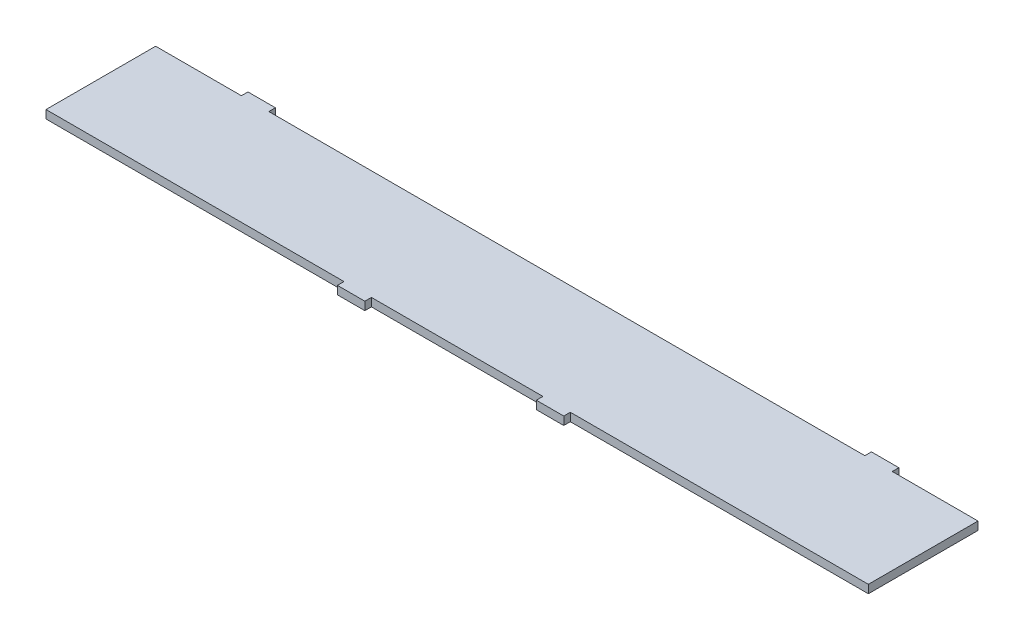
ISO-10303-21;
HEADER;
FILE_DESCRIPTION(('STEP AP214'),'2;1');
FILE_NAME('part.step','',(''),(''),'','','');
FILE_SCHEMA(('AUTOMOTIVE_DESIGN { 1 0 10303 214 1 1 1 1 }'));
ENDSEC;
DATA;
#1=APPLICATION_CONTEXT('core data for automotive mechanical design processes');
#2=APPLICATION_PROTOCOL_DEFINITION('international standard','automotive_design',2000,#1);
#3=PRODUCT_CONTEXT('',#1,'mechanical');
#4=PRODUCT('Part','Part','',(#3));
#5=PRODUCT_RELATED_PRODUCT_CATEGORY('part','',(#4));
#6=PRODUCT_DEFINITION_FORMATION('','',#4);
#7=PRODUCT_DEFINITION_CONTEXT('part definition',#1,'design');
#8=PRODUCT_DEFINITION('design','',#6,#7);
#9=PRODUCT_DEFINITION_SHAPE('','',#8);
#10=(LENGTH_UNIT() NAMED_UNIT(*) SI_UNIT(.MILLI.,.METRE.));
#11=(NAMED_UNIT(*) PLANE_ANGLE_UNIT() SI_UNIT($,.RADIAN.));
#12=(NAMED_UNIT(*) SI_UNIT($,.STERADIAN.) SOLID_ANGLE_UNIT());
#13=UNCERTAINTY_MEASURE_WITH_UNIT(LENGTH_MEASURE(1.E-05),#10,'distance_accuracy_value','');
#14=(GEOMETRIC_REPRESENTATION_CONTEXT(3) GLOBAL_UNCERTAINTY_ASSIGNED_CONTEXT((#13)) GLOBAL_UNIT_ASSIGNED_CONTEXT((#10,
#11,#12)) REPRESENTATION_CONTEXT('',''));
#15=CARTESIAN_POINT('',(0.,0.,0.));
#16=DIRECTION('',(0.,0.,1.));
#17=DIRECTION('',(1.,0.,0.));
#18=AXIS2_PLACEMENT_3D('',#15,#16,#17);
#19=CARTESIAN_POINT('',(-750.,15.,100.));
#20=DIRECTION('',(0.,0.,-1.));
#21=DIRECTION('',(-1.,0.,0.));
#22=AXIS2_PLACEMENT_3D('',#19,#20,#21);
#23=PLANE('',#22);
#24=DIRECTION('',(0.,-1.,0.));
#25=VECTOR('',#24,1.);
#26=CARTESIAN_POINT('',(156.41,15.,100.));
#27=LINE('',#26,#25);
#28=CARTESIAN_POINT('',(156.41,15.,100.));
#29=VERTEX_POINT('',#28);
#30=CARTESIAN_POINT('',(156.41,0.,100.));
#31=VERTEX_POINT('',#30);
#32=EDGE_CURVE('E66',#29,#31,#27,.T.);
#33=ORIENTED_EDGE('',*,*,#32,.F.);
#34=DIRECTION('',(1.,0.,0.));
#35=VECTOR('',#34,1.);
#36=CARTESIAN_POINT('',(-750.,15.,100.));
#37=LINE('',#36,#35);
#38=CARTESIAN_POINT('',(-156.41,15.,100.));
#39=VERTEX_POINT('',#38);
#40=EDGE_CURVE('E188',#39,#29,#37,.T.);
#41=ORIENTED_EDGE('',*,*,#40,.F.);
#42=DIRECTION('',(0.,-1.,0.));
#43=VECTOR('',#42,1.);
#44=CARTESIAN_POINT('',(-156.41,15.,100.));
#45=LINE('',#44,#43);
#46=CARTESIAN_POINT('',(-156.41,0.,100.));
#47=VERTEX_POINT('',#46);
#48=EDGE_CURVE('E267',#39,#47,#45,.T.);
#49=ORIENTED_EDGE('',*,*,#48,.T.);
#50=DIRECTION('',(1.,0.,0.));
#51=VECTOR('',#50,1.);
#52=CARTESIAN_POINT('',(-750.,0.,100.));
#53=LINE('',#52,#51);
#54=EDGE_CURVE('E374',#47,#31,#53,.T.);
#55=ORIENTED_EDGE('',*,*,#54,.T.);
#56=EDGE_LOOP('',(#33,#41,#49,#55));
#57=FACE_BOUND('',#56,.T.);
#58=ADVANCED_FACE('F42',(#57),#23,.F.);
#59=DIRECTION('',(0.,-1.,0.));
#60=VECTOR('',#59,1.);
#61=CARTESIAN_POINT('',(206.41,15.,100.));
#62=LINE('',#61,#60);
#63=CARTESIAN_POINT('',(206.41,15.,100.));
#64=VERTEX_POINT('',#63);
#65=CARTESIAN_POINT('',(206.41,0.,100.));
#66=VERTEX_POINT('',#65);
#67=EDGE_CURVE('E210',#64,#66,#62,.T.);
#68=ORIENTED_EDGE('',*,*,#67,.T.);
#69=CARTESIAN_POINT('',(750.,0.,100.));
#70=VERTEX_POINT('',#69);
#71=EDGE_CURVE('E368',#66,#70,#53,.T.);
#72=ORIENTED_EDGE('',*,*,#71,.T.);
#73=DIRECTION('',(0.,-1.,0.));
#74=VECTOR('',#73,1.);
#75=CARTESIAN_POINT('',(750.,15.,100.));
#76=LINE('',#75,#74);
#77=CARTESIAN_POINT('',(750.,15.,100.));
#78=VERTEX_POINT('',#77);
#79=EDGE_CURVE('E228',#78,#70,#76,.T.);
#80=ORIENTED_EDGE('',*,*,#79,.F.);
#81=EDGE_CURVE('E58',#64,#78,#37,.T.);
#82=ORIENTED_EDGE('',*,*,#81,.F.);
#83=EDGE_LOOP('',(#68,#72,#80,#82));
#84=FACE_BOUND('',#83,.T.);
#85=ADVANCED_FACE('F403',(#84),#23,.F.);
#86=DIRECTION('',(0.,-1.,0.));
#87=VECTOR('',#86,1.);
#88=CARTESIAN_POINT('',(-206.41,15.,100.));
#89=LINE('',#88,#87);
#90=CARTESIAN_POINT('',(-206.41,15.,100.));
#91=VERTEX_POINT('',#90);
#92=CARTESIAN_POINT('',(-206.41,0.,100.));
#93=VERTEX_POINT('',#92);
#94=EDGE_CURVE('E255',#91,#93,#89,.T.);
#95=ORIENTED_EDGE('',*,*,#94,.F.);
#96=CARTESIAN_POINT('',(-750.,15.,100.));
#97=VERTEX_POINT('',#96);
#98=EDGE_CURVE('E222',#97,#91,#37,.T.);
#99=ORIENTED_EDGE('',*,*,#98,.F.);
#100=DIRECTION('',(0.,-1.,0.));
#101=VECTOR('',#100,1.);
#102=CARTESIAN_POINT('',(-750.,15.,100.));
#103=LINE('',#102,#101);
#104=CARTESIAN_POINT('',(-750.,0.,100.));
#105=VERTEX_POINT('',#104);
#106=EDGE_CURVE('E382',#97,#105,#103,.T.);
#107=ORIENTED_EDGE('',*,*,#106,.T.);
#108=EDGE_CURVE('E376',#105,#93,#53,.T.);
#109=ORIENTED_EDGE('',*,*,#108,.T.);
#110=EDGE_LOOP('',(#95,#99,#107,#109));
#111=FACE_BOUND('',#110,.T.);
#112=ADVANCED_FACE('F395',(#111),#23,.F.);
#113=CARTESIAN_POINT('',(-750.,15.,-100.));
#114=DIRECTION('',(0.,0.,1.));
#115=DIRECTION('',(1.,0.,0.));
#116=AXIS2_PLACEMENT_3D('',#113,#114,#115);
#117=PLANE('',#116);
#118=DIRECTION('',(0.,-1.,0.));
#119=VECTOR('',#118,1.);
#120=CARTESIAN_POINT('',(543.59,15.,-100.));
#121=LINE('',#120,#119);
#122=CARTESIAN_POINT('',(543.59,15.,-100.));
#123=VERTEX_POINT('',#122);
#124=CARTESIAN_POINT('',(543.59,0.,-100.));
#125=VERTEX_POINT('',#124);
#126=EDGE_CURVE('E325',#123,#125,#121,.T.);
#127=ORIENTED_EDGE('',*,*,#126,.T.);
#128=DIRECTION('',(-1.,0.,0.));
#129=VECTOR('',#128,1.);
#130=CARTESIAN_POINT('',(-750.,0.,-100.));
#131=LINE('',#130,#129);
#132=CARTESIAN_POINT('',(-543.59,0.,-100.));
#133=VERTEX_POINT('',#132);
#134=EDGE_CURVE('E355',#125,#133,#131,.T.);
#135=ORIENTED_EDGE('',*,*,#134,.T.);
#136=DIRECTION('',(0.,-1.,0.));
#137=VECTOR('',#136,1.);
#138=CARTESIAN_POINT('',(-543.59,15.,-100.));
#139=LINE('',#138,#137);
#140=CARTESIAN_POINT('',(-543.59,15.,-100.));
#141=VERTEX_POINT('',#140);
#142=EDGE_CURVE('E317',#141,#133,#139,.T.);
#143=ORIENTED_EDGE('',*,*,#142,.F.);
#144=DIRECTION('',(-1.,0.,0.));
#145=VECTOR('',#144,1.);
#146=CARTESIAN_POINT('',(-750.,15.,-100.));
#147=LINE('',#146,#145);
#148=EDGE_CURVE('E301',#123,#141,#147,.T.);
#149=ORIENTED_EDGE('',*,*,#148,.F.);
#150=EDGE_LOOP('',(#127,#135,#143,#149));
#151=FACE_BOUND('',#150,.T.);
#152=ADVANCED_FACE('F418',(#151),#117,.F.);
#153=DIRECTION('',(0.,-1.,0.));
#154=VECTOR('',#153,1.);
#155=CARTESIAN_POINT('',(593.59,15.,-100.));
#156=LINE('',#155,#154);
#157=CARTESIAN_POINT('',(593.59,15.,-100.));
#158=VERTEX_POINT('',#157);
#159=CARTESIAN_POINT('',(593.59,0.,-100.));
#160=VERTEX_POINT('',#159);
#161=EDGE_CURVE('E431',#158,#160,#156,.T.);
#162=ORIENTED_EDGE('',*,*,#161,.F.);
#163=CARTESIAN_POINT('',(750.,15.,-100.));
#164=VERTEX_POINT('',#163);
#165=EDGE_CURVE('E296',#164,#158,#147,.T.);
#166=ORIENTED_EDGE('',*,*,#165,.F.);
#167=DIRECTION('',(0.,-1.,0.));
#168=VECTOR('',#167,1.);
#169=CARTESIAN_POINT('',(750.,15.,-100.));
#170=LINE('',#169,#168);
#171=CARTESIAN_POINT('',(750.,0.,-100.));
#172=VERTEX_POINT('',#171);
#173=EDGE_CURVE('E12',#164,#172,#170,.T.);
#174=ORIENTED_EDGE('',*,*,#173,.T.);
#175=EDGE_CURVE('E356',#172,#160,#131,.T.);
#176=ORIENTED_EDGE('',*,*,#175,.T.);
#177=EDGE_LOOP('',(#162,#166,#174,#176));
#178=FACE_BOUND('',#177,.T.);
#179=ADVANCED_FACE('F468',(#178),#117,.F.);
#180=CARTESIAN_POINT('',(750.,15.,100.));
#181=DIRECTION('',(-1.,0.,0.));
#182=DIRECTION('',(0.,0.,1.));
#183=AXIS2_PLACEMENT_3D('',#180,#181,#182);
#184=PLANE('',#183);
#185=DIRECTION('',(0.,0.,-1.));
#186=VECTOR('',#185,1.);
#187=CARTESIAN_POINT('',(750.,0.,100.));
#188=LINE('',#187,#186);
#189=EDGE_CURVE('E232',#70,#172,#188,.T.);
#190=ORIENTED_EDGE('',*,*,#189,.T.);
#191=ORIENTED_EDGE('',*,*,#173,.F.);
#192=DIRECTION('',(0.,0.,-1.));
#193=VECTOR('',#192,1.);
#194=CARTESIAN_POINT('',(750.,15.,100.));
#195=LINE('',#194,#193);
#196=EDGE_CURVE('E303',#78,#164,#195,.T.);
#197=ORIENTED_EDGE('',*,*,#196,.F.);
#198=ORIENTED_EDGE('',*,*,#79,.T.);
#199=EDGE_LOOP('',(#190,#191,#197,#198));
#200=FACE_BOUND('',#199,.T.);
#201=ADVANCED_FACE('F44',(#200),#184,.F.);
#202=CARTESIAN_POINT('',(-593.59,15.,-100.));
#203=VERTEX_POINT('',#202);
#204=CARTESIAN_POINT('',(-750.,15.,-100.));
#205=VERTEX_POINT('',#204);
#206=EDGE_CURVE('E302',#203,#205,#147,.T.);
#207=ORIENTED_EDGE('',*,*,#206,.F.);
#208=DIRECTION('',(0.,-1.,0.));
#209=VECTOR('',#208,1.);
#210=CARTESIAN_POINT('',(-593.59,15.,-100.));
#211=LINE('',#210,#209);
#212=CARTESIAN_POINT('',(-593.59,0.,-100.));
#213=VERTEX_POINT('',#212);
#214=EDGE_CURVE('E335',#203,#213,#211,.T.);
#215=ORIENTED_EDGE('',*,*,#214,.T.);
#216=CARTESIAN_POINT('',(-750.,0.,-100.));
#217=VERTEX_POINT('',#216);
#218=EDGE_CURVE('E349',#213,#217,#131,.T.);
#219=ORIENTED_EDGE('',*,*,#218,.T.);
#220=DIRECTION('',(0.,-1.,0.));
#221=VECTOR('',#220,1.);
#222=CARTESIAN_POINT('',(-750.,15.,-100.));
#223=LINE('',#222,#221);
#224=EDGE_CURVE('E51',#205,#217,#223,.T.);
#225=ORIENTED_EDGE('',*,*,#224,.F.);
#226=EDGE_LOOP('',(#207,#215,#219,#225));
#227=FACE_BOUND('',#226,.T.);
#228=ADVANCED_FACE('F498',(#227),#117,.F.);
#229=CARTESIAN_POINT('',(-750.,15.,100.));
#230=DIRECTION('',(1.,0.,0.));
#231=DIRECTION('',(0.,0.,-1.));
#232=AXIS2_PLACEMENT_3D('',#229,#230,#231);
#233=PLANE('',#232);
#234=DIRECTION('',(0.,0.,1.));
#235=VECTOR('',#234,1.);
#236=CARTESIAN_POINT('',(-750.,0.,100.));
#237=LINE('',#236,#235);
#238=EDGE_CURVE('E364',#217,#105,#237,.T.);
#239=ORIENTED_EDGE('',*,*,#238,.T.);
#240=ORIENTED_EDGE('',*,*,#106,.F.);
#241=DIRECTION('',(0.,0.,1.));
#242=VECTOR('',#241,1.);
#243=CARTESIAN_POINT('',(-750.,15.,100.));
#244=LINE('',#243,#242);
#245=EDGE_CURVE('E229',#205,#97,#244,.T.);
#246=ORIENTED_EDGE('',*,*,#245,.F.);
#247=ORIENTED_EDGE('',*,*,#224,.T.);
#248=EDGE_LOOP('',(#239,#240,#246,#247));
#249=FACE_BOUND('',#248,.T.);
#250=ADVANCED_FACE('F386',(#249),#233,.F.);
#251=CARTESIAN_POINT('',(0.,15.,0.));
#252=DIRECTION('',(0.,-1.,0.));
#253=DIRECTION('',(0.,0.,-1.));
#254=AXIS2_PLACEMENT_3D('',#251,#252,#253);
#255=PLANE('',#254);
#256=ORIENTED_EDGE('',*,*,#196,.T.);
#257=ORIENTED_EDGE('',*,*,#165,.T.);
#258=DIRECTION('',(0.,0.,-1.));
#259=VECTOR('',#258,1.);
#260=CARTESIAN_POINT('',(593.59,15.,-100.));
#261=LINE('',#260,#259);
#262=CARTESIAN_POINT('',(593.59,15.,-112.));
#263=VERTEX_POINT('',#262);
#264=EDGE_CURVE('E285',#158,#263,#261,.T.);
#265=ORIENTED_EDGE('',*,*,#264,.T.);
#266=DIRECTION('',(-1.,0.,0.));
#267=VECTOR('',#266,1.);
#268=CARTESIAN_POINT('',(543.59,15.,-112.));
#269=LINE('',#268,#267);
#270=CARTESIAN_POINT('',(543.59,15.,-112.));
#271=VERTEX_POINT('',#270);
#272=EDGE_CURVE('E442',#263,#271,#269,.T.);
#273=ORIENTED_EDGE('',*,*,#272,.T.);
#274=DIRECTION('',(0.,0.,1.));
#275=VECTOR('',#274,1.);
#276=CARTESIAN_POINT('',(543.59,15.,-100.));
#277=LINE('',#276,#275);
#278=EDGE_CURVE('E280',#271,#123,#277,.T.);
#279=ORIENTED_EDGE('',*,*,#278,.T.);
#280=ORIENTED_EDGE('',*,*,#148,.T.);
#281=DIRECTION('',(0.,0.,-1.));
#282=VECTOR('',#281,1.);
#283=CARTESIAN_POINT('',(-543.59,15.,-100.));
#284=LINE('',#283,#282);
#285=CARTESIAN_POINT('',(-543.59,15.,-112.));
#286=VERTEX_POINT('',#285);
#287=EDGE_CURVE('E331',#141,#286,#284,.T.);
#288=ORIENTED_EDGE('',*,*,#287,.T.);
#289=DIRECTION('',(-1.,0.,0.));
#290=VECTOR('',#289,1.);
#291=CARTESIAN_POINT('',(-543.59,15.,-112.));
#292=LINE('',#291,#290);
#293=CARTESIAN_POINT('',(-593.59,15.,-112.));
#294=VERTEX_POINT('',#293);
#295=EDGE_CURVE('E318',#286,#294,#292,.T.);
#296=ORIENTED_EDGE('',*,*,#295,.T.);
#297=DIRECTION('',(0.,0.,1.));
#298=VECTOR('',#297,1.);
#299=CARTESIAN_POINT('',(-593.59,15.,-100.));
#300=LINE('',#299,#298);
#301=EDGE_CURVE('E313',#294,#203,#300,.T.);
#302=ORIENTED_EDGE('',*,*,#301,.T.);
#303=ORIENTED_EDGE('',*,*,#206,.T.);
#304=ORIENTED_EDGE('',*,*,#245,.T.);
#305=ORIENTED_EDGE('',*,*,#98,.T.);
#306=DIRECTION('',(0.,0.,1.));
#307=VECTOR('',#306,1.);
#308=CARTESIAN_POINT('',(-206.41,15.,100.));
#309=LINE('',#308,#307);
#310=CARTESIAN_POINT('',(-206.41,15.,112.));
#311=VERTEX_POINT('',#310);
#312=EDGE_CURVE('E242',#91,#311,#309,.T.);
#313=ORIENTED_EDGE('',*,*,#312,.T.);
#314=DIRECTION('',(1.,0.,0.));
#315=VECTOR('',#314,1.);
#316=CARTESIAN_POINT('',(-206.41,15.,112.));
#317=LINE('',#316,#315);
#318=CARTESIAN_POINT('',(-156.41,15.,112.));
#319=VERTEX_POINT('',#318);
#320=EDGE_CURVE('E247',#311,#319,#317,.T.);
#321=ORIENTED_EDGE('',*,*,#320,.T.);
#322=DIRECTION('',(0.,0.,-1.));
#323=VECTOR('',#322,1.);
#324=CARTESIAN_POINT('',(-156.41,15.,100.));
#325=LINE('',#324,#323);
#326=EDGE_CURVE('E251',#319,#39,#325,.T.);
#327=ORIENTED_EDGE('',*,*,#326,.T.);
#328=ORIENTED_EDGE('',*,*,#40,.T.);
#329=DIRECTION('',(0.,0.,1.));
#330=VECTOR('',#329,1.);
#331=CARTESIAN_POINT('',(156.41,15.,100.));
#332=LINE('',#331,#330);
#333=CARTESIAN_POINT('',(156.41,15.,112.));
#334=VERTEX_POINT('',#333);
#335=EDGE_CURVE('E181',#29,#334,#332,.T.);
#336=ORIENTED_EDGE('',*,*,#335,.T.);
#337=DIRECTION('',(1.,0.,0.));
#338=VECTOR('',#337,1.);
#339=CARTESIAN_POINT('',(206.41,15.,112.));
#340=LINE('',#339,#338);
#341=CARTESIAN_POINT('',(206.41,15.,112.));
#342=VERTEX_POINT('',#341);
#343=EDGE_CURVE('E186',#334,#342,#340,.T.);
#344=ORIENTED_EDGE('',*,*,#343,.T.);
#345=DIRECTION('',(0.,0.,-1.));
#346=VECTOR('',#345,1.);
#347=CARTESIAN_POINT('',(206.41,15.,100.));
#348=LINE('',#347,#346);
#349=EDGE_CURVE('E207',#342,#64,#348,.T.);
#350=ORIENTED_EDGE('',*,*,#349,.T.);
#351=ORIENTED_EDGE('',*,*,#81,.T.);
#352=EDGE_LOOP('',(#256,#257,#265,#273,#279,#280,#288,#296,#302,#303,#304,#305,#313,#321,#327,
#328,#336,#344,#350,#351));
#353=FACE_BOUND('',#352,.T.);
#354=ADVANCED_FACE('F184',(#353),#255,.F.);
#355=CARTESIAN_POINT('',(0.,0.,0.));
#356=DIRECTION('',(0.,-1.,0.));
#357=DIRECTION('',(0.,0.,-1.));
#358=AXIS2_PLACEMENT_3D('',#355,#356,#357);
#359=PLANE('',#358);
#360=ORIENTED_EDGE('',*,*,#189,.F.);
#361=ORIENTED_EDGE('',*,*,#71,.F.);
#362=DIRECTION('',(0.,0.,-1.));
#363=VECTOR('',#362,1.);
#364=CARTESIAN_POINT('',(206.41,0.,100.));
#365=LINE('',#364,#363);
#366=CARTESIAN_POINT('',(206.41,0.,112.));
#367=VERTEX_POINT('',#366);
#368=EDGE_CURVE('E191',#367,#66,#365,.T.);
#369=ORIENTED_EDGE('',*,*,#368,.F.);
#370=DIRECTION('',(1.,0.,0.));
#371=VECTOR('',#370,1.);
#372=CARTESIAN_POINT('',(206.41,0.,112.));
#373=LINE('',#372,#371);
#374=CARTESIAN_POINT('',(156.41,0.,112.));
#375=VERTEX_POINT('',#374);
#376=EDGE_CURVE('E461',#375,#367,#373,.T.);
#377=ORIENTED_EDGE('',*,*,#376,.F.);
#378=DIRECTION('',(0.,0.,1.));
#379=VECTOR('',#378,1.);
#380=CARTESIAN_POINT('',(156.41,0.,100.));
#381=LINE('',#380,#379);
#382=EDGE_CURVE('E197',#31,#375,#381,.T.);
#383=ORIENTED_EDGE('',*,*,#382,.F.);
#384=ORIENTED_EDGE('',*,*,#54,.F.);
#385=DIRECTION('',(0.,0.,-1.));
#386=VECTOR('',#385,1.);
#387=CARTESIAN_POINT('',(-156.41,0.,100.));
#388=LINE('',#387,#386);
#389=CARTESIAN_POINT('',(-156.41,0.,112.));
#390=VERTEX_POINT('',#389);
#391=EDGE_CURVE('E248',#390,#47,#388,.T.);
#392=ORIENTED_EDGE('',*,*,#391,.F.);
#393=DIRECTION('',(1.,0.,0.));
#394=VECTOR('',#393,1.);
#395=CARTESIAN_POINT('',(-206.41,0.,112.));
#396=LINE('',#395,#394);
#397=CARTESIAN_POINT('',(-206.41,0.,112.));
#398=VERTEX_POINT('',#397);
#399=EDGE_CURVE('E260',#398,#390,#396,.T.);
#400=ORIENTED_EDGE('',*,*,#399,.F.);
#401=DIRECTION('',(0.,0.,1.));
#402=VECTOR('',#401,1.);
#403=CARTESIAN_POINT('',(-206.41,0.,100.));
#404=LINE('',#403,#402);
#405=EDGE_CURVE('E256',#93,#398,#404,.T.);
#406=ORIENTED_EDGE('',*,*,#405,.F.);
#407=ORIENTED_EDGE('',*,*,#108,.F.);
#408=ORIENTED_EDGE('',*,*,#238,.F.);
#409=ORIENTED_EDGE('',*,*,#218,.F.);
#410=DIRECTION('',(0.,0.,1.));
#411=VECTOR('',#410,1.);
#412=CARTESIAN_POINT('',(-593.59,0.,-100.));
#413=LINE('',#412,#411);
#414=CARTESIAN_POINT('',(-593.59,0.,-112.));
#415=VERTEX_POINT('',#414);
#416=EDGE_CURVE('E328',#415,#213,#413,.T.);
#417=ORIENTED_EDGE('',*,*,#416,.F.);
#418=DIRECTION('',(-1.,0.,0.));
#419=VECTOR('',#418,1.);
#420=CARTESIAN_POINT('',(-543.59,0.,-112.));
#421=LINE('',#420,#419);
#422=CARTESIAN_POINT('',(-543.59,0.,-112.));
#423=VERTEX_POINT('',#422);
#424=EDGE_CURVE('E324',#423,#415,#421,.T.);
#425=ORIENTED_EDGE('',*,*,#424,.F.);
#426=DIRECTION('',(0.,0.,-1.));
#427=VECTOR('',#426,1.);
#428=CARTESIAN_POINT('',(-543.59,0.,-100.));
#429=LINE('',#428,#427);
#430=EDGE_CURVE('E320',#133,#423,#429,.T.);
#431=ORIENTED_EDGE('',*,*,#430,.F.);
#432=ORIENTED_EDGE('',*,*,#134,.F.);
#433=DIRECTION('',(0.,0.,1.));
#434=VECTOR('',#433,1.);
#435=CARTESIAN_POINT('',(543.59,0.,-100.));
#436=LINE('',#435,#434);
#437=CARTESIAN_POINT('',(543.59,0.,-112.));
#438=VERTEX_POINT('',#437);
#439=EDGE_CURVE('E279',#438,#125,#436,.T.);
#440=ORIENTED_EDGE('',*,*,#439,.F.);
#441=DIRECTION('',(-1.,0.,0.));
#442=VECTOR('',#441,1.);
#443=CARTESIAN_POINT('',(543.59,0.,-112.));
#444=LINE('',#443,#442);
#445=CARTESIAN_POINT('',(593.59,0.,-112.));
#446=VERTEX_POINT('',#445);
#447=EDGE_CURVE('E286',#446,#438,#444,.T.);
#448=ORIENTED_EDGE('',*,*,#447,.F.);
#449=DIRECTION('',(0.,0.,-1.));
#450=VECTOR('',#449,1.);
#451=CARTESIAN_POINT('',(593.59,0.,-100.));
#452=LINE('',#451,#450);
#453=EDGE_CURVE('E447',#160,#446,#452,.T.);
#454=ORIENTED_EDGE('',*,*,#453,.F.);
#455=ORIENTED_EDGE('',*,*,#175,.F.);
#456=EDGE_LOOP('',(#360,#361,#369,#377,#383,#384,#392,#400,#406,#407,#408,#409,#417,#425,#431,
#432,#440,#448,#454,#455));
#457=FACE_BOUND('',#456,.T.);
#458=ADVANCED_FACE('F390',(#457),#359,.T.);
#459=CARTESIAN_POINT('',(-543.59,15.,-100.));
#460=DIRECTION('',(-1.,0.,0.));
#461=DIRECTION('',(0.,0.,1.));
#462=AXIS2_PLACEMENT_3D('',#459,#460,#461);
#463=PLANE('',#462);
#464=ORIENTED_EDGE('',*,*,#430,.T.);
#465=DIRECTION('',(0.,-1.,0.));
#466=VECTOR('',#465,1.);
#467=CARTESIAN_POINT('',(-543.59,15.,-112.));
#468=LINE('',#467,#466);
#469=EDGE_CURVE('E342',#286,#423,#468,.T.);
#470=ORIENTED_EDGE('',*,*,#469,.F.);
#471=ORIENTED_EDGE('',*,*,#287,.F.);
#472=ORIENTED_EDGE('',*,*,#142,.T.);
#473=EDGE_LOOP('',(#464,#470,#471,#472));
#474=FACE_BOUND('',#473,.T.);
#475=ADVANCED_FACE('F415',(#474),#463,.F.);
#476=CARTESIAN_POINT('',(-543.59,15.,-112.));
#477=DIRECTION('',(0.,0.,1.));
#478=DIRECTION('',(1.,0.,0.));
#479=AXIS2_PLACEMENT_3D('',#476,#477,#478);
#480=PLANE('',#479);
#481=ORIENTED_EDGE('',*,*,#424,.T.);
#482=DIRECTION('',(0.,-1.,0.));
#483=VECTOR('',#482,1.);
#484=CARTESIAN_POINT('',(-593.59,15.,-112.));
#485=LINE('',#484,#483);
#486=EDGE_CURVE('E339',#294,#415,#485,.T.);
#487=ORIENTED_EDGE('',*,*,#486,.F.);
#488=ORIENTED_EDGE('',*,*,#295,.F.);
#489=ORIENTED_EDGE('',*,*,#469,.T.);
#490=EDGE_LOOP('',(#481,#487,#488,#489));
#491=FACE_BOUND('',#490,.T.);
#492=ADVANCED_FACE('F423',(#491),#480,.F.);
#493=CARTESIAN_POINT('',(-593.59,15.,-100.));
#494=DIRECTION('',(1.,0.,0.));
#495=DIRECTION('',(0.,0.,-1.));
#496=AXIS2_PLACEMENT_3D('',#493,#494,#495);
#497=PLANE('',#496);
#498=ORIENTED_EDGE('',*,*,#416,.T.);
#499=ORIENTED_EDGE('',*,*,#214,.F.);
#500=ORIENTED_EDGE('',*,*,#301,.F.);
#501=ORIENTED_EDGE('',*,*,#486,.T.);
#502=EDGE_LOOP('',(#498,#499,#500,#501));
#503=FACE_BOUND('',#502,.T.);
#504=ADVANCED_FACE('F426',(#503),#497,.F.);
#505=CARTESIAN_POINT('',(543.59,15.,-100.));
#506=DIRECTION('',(1.,0.,0.));
#507=DIRECTION('',(0.,0.,-1.));
#508=AXIS2_PLACEMENT_3D('',#505,#506,#507);
#509=PLANE('',#508);
#510=ORIENTED_EDGE('',*,*,#439,.T.);
#511=ORIENTED_EDGE('',*,*,#126,.F.);
#512=ORIENTED_EDGE('',*,*,#278,.F.);
#513=DIRECTION('',(0.,-1.,0.));
#514=VECTOR('',#513,1.);
#515=CARTESIAN_POINT('',(543.59,15.,-112.));
#516=LINE('',#515,#514);
#517=EDGE_CURVE('E438',#271,#438,#516,.T.);
#518=ORIENTED_EDGE('',*,*,#517,.T.);
#519=EDGE_LOOP('',(#510,#511,#512,#518));
#520=FACE_BOUND('',#519,.T.);
#521=ADVANCED_FACE('F478',(#520),#509,.F.);
#522=CARTESIAN_POINT('',(593.59,15.,-100.));
#523=DIRECTION('',(-1.,0.,0.));
#524=DIRECTION('',(0.,0.,1.));
#525=AXIS2_PLACEMENT_3D('',#522,#523,#524);
#526=PLANE('',#525);
#527=ORIENTED_EDGE('',*,*,#453,.T.);
#528=DIRECTION('',(0.,-1.,0.));
#529=VECTOR('',#528,1.);
#530=CARTESIAN_POINT('',(593.59,15.,-112.));
#531=LINE('',#530,#529);
#532=EDGE_CURVE('E434',#263,#446,#531,.T.);
#533=ORIENTED_EDGE('',*,*,#532,.F.);
#534=ORIENTED_EDGE('',*,*,#264,.F.);
#535=ORIENTED_EDGE('',*,*,#161,.T.);
#536=EDGE_LOOP('',(#527,#533,#534,#535));
#537=FACE_BOUND('',#536,.T.);
#538=ADVANCED_FACE('F472',(#537),#526,.F.);
#539=CARTESIAN_POINT('',(543.59,15.,-112.));
#540=DIRECTION('',(0.,0.,1.));
#541=DIRECTION('',(1.,0.,0.));
#542=AXIS2_PLACEMENT_3D('',#539,#540,#541);
#543=PLANE('',#542);
#544=ORIENTED_EDGE('',*,*,#447,.T.);
#545=ORIENTED_EDGE('',*,*,#517,.F.);
#546=ORIENTED_EDGE('',*,*,#272,.F.);
#547=ORIENTED_EDGE('',*,*,#532,.T.);
#548=EDGE_LOOP('',(#544,#545,#546,#547));
#549=FACE_BOUND('',#548,.T.);
#550=ADVANCED_FACE('F476',(#549),#543,.F.);
#551=CARTESIAN_POINT('',(-206.41,15.,100.));
#552=DIRECTION('',(1.,0.,0.));
#553=DIRECTION('',(0.,0.,-1.));
#554=AXIS2_PLACEMENT_3D('',#551,#552,#553);
#555=PLANE('',#554);
#556=ORIENTED_EDGE('',*,*,#405,.T.);
#557=DIRECTION('',(0.,-1.,0.));
#558=VECTOR('',#557,1.);
#559=CARTESIAN_POINT('',(-206.41,15.,112.));
#560=LINE('',#559,#558);
#561=EDGE_CURVE('E275',#311,#398,#560,.T.);
#562=ORIENTED_EDGE('',*,*,#561,.F.);
#563=ORIENTED_EDGE('',*,*,#312,.F.);
#564=ORIENTED_EDGE('',*,*,#94,.T.);
#565=EDGE_LOOP('',(#556,#562,#563,#564));
#566=FACE_BOUND('',#565,.T.);
#567=ADVANCED_FACE('F581',(#566),#555,.F.);
#568=CARTESIAN_POINT('',(-206.41,15.,112.));
#569=DIRECTION('',(0.,0.,-1.));
#570=DIRECTION('',(-1.,0.,0.));
#571=AXIS2_PLACEMENT_3D('',#568,#569,#570);
#572=PLANE('',#571);
#573=ORIENTED_EDGE('',*,*,#399,.T.);
#574=DIRECTION('',(0.,-1.,0.));
#575=VECTOR('',#574,1.);
#576=CARTESIAN_POINT('',(-156.41,15.,112.));
#577=LINE('',#576,#575);
#578=EDGE_CURVE('E271',#319,#390,#577,.T.);
#579=ORIENTED_EDGE('',*,*,#578,.F.);
#580=ORIENTED_EDGE('',*,*,#320,.F.);
#581=ORIENTED_EDGE('',*,*,#561,.T.);
#582=EDGE_LOOP('',(#573,#579,#580,#581));
#583=FACE_BOUND('',#582,.T.);
#584=ADVANCED_FACE('F590',(#583),#572,.F.);
#585=CARTESIAN_POINT('',(-156.41,15.,100.));
#586=DIRECTION('',(-1.,0.,0.));
#587=DIRECTION('',(0.,0.,1.));
#588=AXIS2_PLACEMENT_3D('',#585,#586,#587);
#589=PLANE('',#588);
#590=ORIENTED_EDGE('',*,*,#391,.T.);
#591=ORIENTED_EDGE('',*,*,#48,.F.);
#592=ORIENTED_EDGE('',*,*,#326,.F.);
#593=ORIENTED_EDGE('',*,*,#578,.T.);
#594=EDGE_LOOP('',(#590,#591,#592,#593));
#595=FACE_BOUND('',#594,.T.);
#596=ADVANCED_FACE('F600',(#595),#589,.F.);
#597=CARTESIAN_POINT('',(156.41,15.,100.));
#598=DIRECTION('',(1.,0.,0.));
#599=DIRECTION('',(0.,0.,-1.));
#600=AXIS2_PLACEMENT_3D('',#597,#598,#599);
#601=PLANE('',#600);
#602=ORIENTED_EDGE('',*,*,#382,.T.);
#603=DIRECTION('',(0.,-1.,0.));
#604=VECTOR('',#603,1.);
#605=CARTESIAN_POINT('',(156.41,15.,112.));
#606=LINE('',#605,#604);
#607=EDGE_CURVE('E194',#334,#375,#606,.T.);
#608=ORIENTED_EDGE('',*,*,#607,.F.);
#609=ORIENTED_EDGE('',*,*,#335,.F.);
#610=ORIENTED_EDGE('',*,*,#32,.T.);
#611=EDGE_LOOP('',(#602,#608,#609,#610));
#612=FACE_BOUND('',#611,.T.);
#613=ADVANCED_FACE('F195',(#612),#601,.F.);
#614=CARTESIAN_POINT('',(206.41,15.,112.));
#615=DIRECTION('',(0.,0.,-1.));
#616=DIRECTION('',(-1.,0.,0.));
#617=AXIS2_PLACEMENT_3D('',#614,#615,#616);
#618=PLANE('',#617);
#619=ORIENTED_EDGE('',*,*,#376,.T.);
#620=DIRECTION('',(0.,-1.,0.));
#621=VECTOR('',#620,1.);
#622=CARTESIAN_POINT('',(206.41,15.,112.));
#623=LINE('',#622,#621);
#624=EDGE_CURVE('E201',#342,#367,#623,.T.);
#625=ORIENTED_EDGE('',*,*,#624,.F.);
#626=ORIENTED_EDGE('',*,*,#343,.F.);
#627=ORIENTED_EDGE('',*,*,#607,.T.);
#628=EDGE_LOOP('',(#619,#625,#626,#627));
#629=FACE_BOUND('',#628,.T.);
#630=ADVANCED_FACE('F203',(#629),#618,.F.);
#631=CARTESIAN_POINT('',(206.41,15.,100.));
#632=DIRECTION('',(-1.,0.,0.));
#633=DIRECTION('',(0.,0.,1.));
#634=AXIS2_PLACEMENT_3D('',#631,#632,#633);
#635=PLANE('',#634);
#636=ORIENTED_EDGE('',*,*,#368,.T.);
#637=ORIENTED_EDGE('',*,*,#67,.F.);
#638=ORIENTED_EDGE('',*,*,#349,.F.);
#639=ORIENTED_EDGE('',*,*,#624,.T.);
#640=EDGE_LOOP('',(#636,#637,#638,#639));
#641=FACE_BOUND('',#640,.T.);
#642=ADVANCED_FACE('F466',(#641),#635,.F.);
#643=CLOSED_SHELL('',(#58,#85,#112,#152,#179,#201,#228,#250,#354,#458,#475,#492,#504,#521,#538,
#550,#567,#584,#596,#613,#630,#642));
#644=MANIFOLD_SOLID_BREP('B2',#643);
#645=ADVANCED_BREP_SHAPE_REPRESENTATION('',(#18,#644),#14);
#646=SHAPE_DEFINITION_REPRESENTATION(#9,#645);
ENDSEC;
END-ISO-10303-21;
